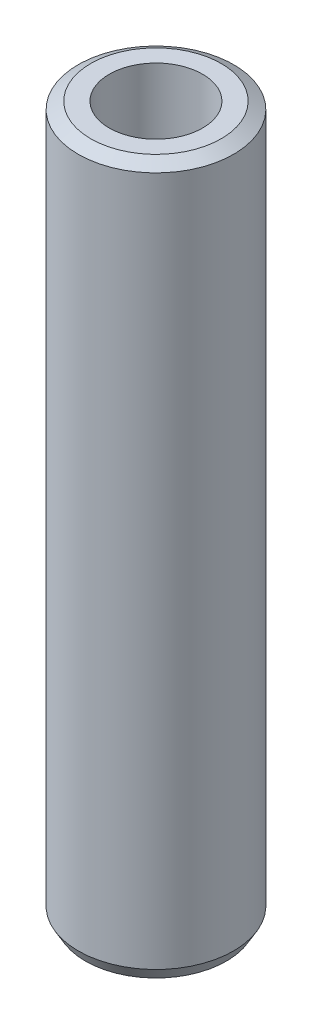
ISO-10303-21;
HEADER;
FILE_DESCRIPTION(('STEP AP214'),'2;1');
FILE_NAME('part.step','',(''),(''),'','','');
FILE_SCHEMA(('AUTOMOTIVE_DESIGN { 1 0 10303 214 1 1 1 1 }'));
ENDSEC;
DATA;
#1=APPLICATION_CONTEXT('core data for automotive mechanical design processes');
#2=APPLICATION_PROTOCOL_DEFINITION('international standard','automotive_design',2000,#1);
#3=PRODUCT_CONTEXT('',#1,'mechanical');
#4=PRODUCT('Part','Part','',(#3));
#5=PRODUCT_RELATED_PRODUCT_CATEGORY('part','',(#4));
#6=PRODUCT_DEFINITION_FORMATION('','',#4);
#7=PRODUCT_DEFINITION_CONTEXT('part definition',#1,'design');
#8=PRODUCT_DEFINITION('design','',#6,#7);
#9=PRODUCT_DEFINITION_SHAPE('','',#8);
#10=(LENGTH_UNIT() NAMED_UNIT(*) SI_UNIT(.MILLI.,.METRE.));
#11=(NAMED_UNIT(*) PLANE_ANGLE_UNIT() SI_UNIT($,.RADIAN.));
#12=(NAMED_UNIT(*) SI_UNIT($,.STERADIAN.) SOLID_ANGLE_UNIT());
#13=UNCERTAINTY_MEASURE_WITH_UNIT(LENGTH_MEASURE(1.E-05),#10,'distance_accuracy_value','');
#14=(GEOMETRIC_REPRESENTATION_CONTEXT(3) GLOBAL_UNCERTAINTY_ASSIGNED_CONTEXT((#13)) GLOBAL_UNIT_ASSIGNED_CONTEXT((#10,
#11,#12)) REPRESENTATION_CONTEXT('',''));
#15=CARTESIAN_POINT('',(0.,0.,0.));
#16=DIRECTION('',(0.,0.,1.));
#17=DIRECTION('',(1.,0.,0.));
#18=AXIS2_PLACEMENT_3D('',#15,#16,#17);
#19=CARTESIAN_POINT('',(0.,91.3014104853771,0.));
#20=DIRECTION('',(0.,-1.,0.));
#21=DIRECTION('',(0.,0.,-1.));
#22=AXIS2_PLACEMENT_3D('',#19,#20,#21);
#23=CYLINDRICAL_SURFACE('',#22,10.);
#24=CARTESIAN_POINT('',(0.,90.3734418318299,0.));
#25=DIRECTION('',(0.,1.,0.));
#26=DIRECTION('',(0.,0.,1.));
#27=AXIS2_PLACEMENT_3D('',#24,#25,#26);
#28=CIRCLE('',#27,10.);
#29=CARTESIAN_POINT('',(0.,90.3734418318299,10.));
#30=VERTEX_POINT('',#29);
#31=EDGE_CURVE('E50',#30,#30,#28,.F.);
#32=ORIENTED_EDGE('',*,*,#31,.T.);
#33=EDGE_LOOP('',(#32));
#34=FACE_BOUND('',#33,.T.);
#35=CARTESIAN_POINT('',(0.,1.607288855775,0.));
#36=DIRECTION('',(0.,1.,0.));
#37=DIRECTION('',(0.,0.,1.));
#38=AXIS2_PLACEMENT_3D('',#35,#36,#37);
#39=CIRCLE('',#38,10.);
#40=CARTESIAN_POINT('',(0.,1.607288855775,10.));
#41=VERTEX_POINT('',#40);
#42=EDGE_CURVE('E51',#41,#41,#39,.T.);
#43=ORIENTED_EDGE('',*,*,#42,.T.);
#44=EDGE_LOOP('',(#43));
#45=FACE_BOUND('',#44,.T.);
#46=ADVANCED_FACE('F39',(#34,#45),#23,.T.);
#47=CARTESIAN_POINT('',(0.,91.3014104853771,0.));
#48=DIRECTION('',(0.,1.,0.));
#49=DIRECTION('',(0.,0.,1.));
#50=AXIS2_PLACEMENT_3D('',#47,#48,#49);
#51=PLANE('',#50);
#52=CARTESIAN_POINT('',(0.,91.3014104853771,0.));
#53=DIRECTION('',(0.,1.,0.));
#54=DIRECTION('',(0.,0.,1.));
#55=AXIS2_PLACEMENT_3D('',#52,#53,#54);
#56=CIRCLE('',#55,8.39271114422505);
#57=CARTESIAN_POINT('',(0.,91.3014104853771,8.39271114422505));
#58=VERTEX_POINT('',#57);
#59=EDGE_CURVE('E54',#58,#58,#56,.T.);
#60=ORIENTED_EDGE('',*,*,#59,.T.);
#61=EDGE_LOOP('',(#60));
#62=FACE_BOUND('',#61,.T.);
#63=CARTESIAN_POINT('',(0.,91.3014104853771,0.));
#64=DIRECTION('',(0.,1.,0.));
#65=DIRECTION('',(0.,0.,1.));
#66=AXIS2_PLACEMENT_3D('',#63,#64,#65);
#67=CIRCLE('',#66,6.00686400502853);
#68=CARTESIAN_POINT('',(0.,91.3014104853771,6.00686400502853));
#69=VERTEX_POINT('',#68);
#70=EDGE_CURVE('E58',#69,#69,#67,.T.);
#71=ORIENTED_EDGE('',*,*,#70,.F.);
#72=EDGE_LOOP('',(#71));
#73=FACE_BOUND('',#72,.T.);
#74=ADVANCED_FACE('F69',(#62,#73),#51,.T.);
#75=CARTESIAN_POINT('',(0.,0.,0.));
#76=DIRECTION('',(0.,1.,0.));
#77=DIRECTION('',(0.,0.,1.));
#78=AXIS2_PLACEMENT_3D('',#75,#76,#77);
#79=PLANE('',#78);
#80=CARTESIAN_POINT('',(0.,0.,0.));
#81=DIRECTION('',(0.,1.,0.));
#82=DIRECTION('',(0.,0.,1.));
#83=AXIS2_PLACEMENT_3D('',#80,#81,#82);
#84=CIRCLE('',#83,9.07203134645281);
#85=CARTESIAN_POINT('',(0.,0.,9.07203134645281));
#86=VERTEX_POINT('',#85);
#87=EDGE_CURVE('E10',#86,#86,#84,.F.);
#88=ORIENTED_EDGE('',*,*,#87,.T.);
#89=EDGE_LOOP('',(#88));
#90=FACE_BOUND('',#89,.T.);
#91=CARTESIAN_POINT('',(0.,0.,0.));
#92=DIRECTION('',(0.,1.,0.));
#93=DIRECTION('',(0.,0.,1.));
#94=AXIS2_PLACEMENT_3D('',#91,#92,#93);
#95=CIRCLE('',#94,6.00686400502853);
#96=CARTESIAN_POINT('',(0.,0.,6.00686400502853));
#97=VERTEX_POINT('',#96);
#98=EDGE_CURVE('E63',#97,#97,#95,.T.);
#99=ORIENTED_EDGE('',*,*,#98,.T.);
#100=EDGE_LOOP('',(#99));
#101=FACE_BOUND('',#100,.T.);
#102=ADVANCED_FACE('F75',(#90,#101),#79,.F.);
#103=CARTESIAN_POINT('',(0.,91.3014104853771,0.));
#104=DIRECTION('',(0.,-1.,0.));
#105=DIRECTION('',(0.,0.,-1.));
#106=AXIS2_PLACEMENT_3D('',#103,#104,#105);
#107=CYLINDRICAL_SURFACE('',#106,6.00686400502853);
#108=ORIENTED_EDGE('',*,*,#70,.T.);
#109=EDGE_LOOP('',(#108));
#110=FACE_BOUND('',#109,.T.);
#111=ORIENTED_EDGE('',*,*,#98,.F.);
#112=EDGE_LOOP('',(#111));
#113=FACE_BOUND('',#112,.T.);
#114=ADVANCED_FACE('F70',(#110,#113),#107,.F.);
#115=CARTESIAN_POINT('',(0.,91.3014104853771,0.));
#116=DIRECTION('',(0.,-1.,0.));
#117=DIRECTION('',(0.,0.,-1.));
#118=AXIS2_PLACEMENT_3D('',#115,#116,#117);
#119=CONICAL_SURFACE('',#118,8.39271114422505,1.04719755119659);
#120=ORIENTED_EDGE('',*,*,#31,.F.);
#121=EDGE_LOOP('',(#120));
#122=FACE_BOUND('',#121,.T.);
#123=ORIENTED_EDGE('',*,*,#59,.F.);
#124=EDGE_LOOP('',(#123));
#125=FACE_BOUND('',#124,.T.);
#126=ADVANCED_FACE('F81',(#122,#125),#119,.T.);
#127=CARTESIAN_POINT('',(0.,1.607288855775,0.));
#128=DIRECTION('',(0.,1.,0.));
#129=DIRECTION('',(0.,0.,1.));
#130=AXIS2_PLACEMENT_3D('',#127,#128,#129);
#131=CONICAL_SURFACE('',#130,10.,0.523598775598301);
#132=CARTESIAN_POINT('',(0.,0.,9.07203134645281));
#133=CARTESIAN_POINT('',(0.,0.0167425922476565,9.08169768659393));
#134=CARTESIAN_POINT('',(0.,0.0334851844953127,9.09136402673504));
#135=CARTESIAN_POINT('',(0.,0.066970368990625,9.11069670701728));
#136=CARTESIAN_POINT('',(0.,0.0837129612382811,9.12036304715839));
#137=CARTESIAN_POINT('',(0.,0.117198145733594,9.13969572744063));
#138=CARTESIAN_POINT('',(0.,0.13394073798125,9.14936206758174));
#139=CARTESIAN_POINT('',(0.,0.167425922476563,9.16869474786398));
#140=CARTESIAN_POINT('',(0.,0.184168514724219,9.17836108800509));
#141=CARTESIAN_POINT('',(0.,0.217653699219532,9.19769376828733));
#142=CARTESIAN_POINT('',(0.,0.234396291467188,9.20736010842844));
#143=CARTESIAN_POINT('',(0.,0.267881475962501,9.22669278871068));
#144=CARTESIAN_POINT('',(0.,0.284624068210157,9.23635912885179));
#145=CARTESIAN_POINT('',(0.,0.318109252705469,9.25569180913403));
#146=CARTESIAN_POINT('',(0.,0.334851844953126,9.26535814927514));
#147=CARTESIAN_POINT('',(0.,0.368337029448439,9.28469082955738));
#148=CARTESIAN_POINT('',(0.,0.385079621696095,9.29435716969849));
#149=CARTESIAN_POINT('',(0.,0.418564806191407,9.31368984998073));
#150=CARTESIAN_POINT('',(0.,0.435307398439064,9.32335619012184));
#151=CARTESIAN_POINT('',(0.,0.468792582934376,9.34268887040407));
#152=CARTESIAN_POINT('',(0.,0.485535175182032,9.35235521054519));
#153=CARTESIAN_POINT('',(0.,0.519020359677345,9.37168789082743));
#154=CARTESIAN_POINT('',(0.,0.535762951925001,9.38135423096854));
#155=CARTESIAN_POINT('',(0.,0.569248136420314,9.40068691125077));
#156=CARTESIAN_POINT('',(0.,0.58599072866797,9.41035325139189));
#157=CARTESIAN_POINT('',(0.,0.619475913163283,9.42968593167413));
#158=CARTESIAN_POINT('',(0.,0.636218505410939,9.43935227181524));
#159=CARTESIAN_POINT('',(0.,0.669703689906252,9.45868495209747));
#160=CARTESIAN_POINT('',(0.,0.686446282153908,9.46835129223859));
#161=CARTESIAN_POINT('',(0.,0.719931466649221,9.48768397252082));
#162=CARTESIAN_POINT('',(0.,0.736674058896877,9.49735031266194));
#163=CARTESIAN_POINT('',(0.,0.77015924339219,9.51668299294417));
#164=CARTESIAN_POINT('',(0.,0.786901835639846,9.52634933308529));
#165=CARTESIAN_POINT('',(0.,0.820387020135159,9.54568201336752));
#166=CARTESIAN_POINT('',(0.,0.837129612382815,9.55534835350864));
#167=CARTESIAN_POINT('',(0.,0.870614796878127,9.57468103379087));
#168=CARTESIAN_POINT('',(0.,0.887357389125784,9.58434737393199));
#169=CARTESIAN_POINT('',(0.,0.920842573621096,9.60368005421422));
#170=CARTESIAN_POINT('',(0.,0.937585165868752,9.61334639435534));
#171=CARTESIAN_POINT('',(0.,0.971070350364065,9.63267907463757));
#172=CARTESIAN_POINT('',(0.,0.987812942611722,9.64234541477869));
#173=CARTESIAN_POINT('',(0.,1.02129812710703,9.66167809506092));
#174=CARTESIAN_POINT('',(0.,1.03804071935469,9.67134443520204));
#175=CARTESIAN_POINT('',(0.,1.07152590385,9.69067711548427));
#176=CARTESIAN_POINT('',(0.,1.08826849609766,9.70034345562539));
#177=CARTESIAN_POINT('',(0.,1.12175368059297,9.71967613590762));
#178=CARTESIAN_POINT('',(0.,1.13849627284063,9.72934247604874));
#179=CARTESIAN_POINT('',(0.,1.17198145733594,9.74867515633097));
#180=CARTESIAN_POINT('',(0.,1.1887240495836,9.75834149647209));
#181=CARTESIAN_POINT('',(0.,1.22220923407891,9.77767417675432));
#182=CARTESIAN_POINT('',(0.,1.23895182632657,9.78734051689544));
#183=CARTESIAN_POINT('',(0.,1.27243701082188,9.80667319717767));
#184=CARTESIAN_POINT('',(0.,1.28917960306954,9.81633953731879));
#185=CARTESIAN_POINT('',(0.,1.32266478756485,9.83567221760102));
#186=CARTESIAN_POINT('',(0.,1.3394073798125,9.84533855774214));
#187=CARTESIAN_POINT('',(0.,1.37289256430782,9.86467123802437));
#188=CARTESIAN_POINT('',(0.,1.38963515655547,9.87433757816548));
#189=CARTESIAN_POINT('',(0.,1.42312034105079,9.89367025844772));
#190=CARTESIAN_POINT('',(0.,1.43986293329844,9.90333659858883));
#191=CARTESIAN_POINT('',(0.,1.47334811779375,9.92266927887107));
#192=CARTESIAN_POINT('',(0.,1.49009071004141,9.93233561901218));
#193=CARTESIAN_POINT('',(0.,1.52357589453672,9.95166829929442));
#194=CARTESIAN_POINT('',(0.,1.54031848678438,9.96133463943553));
#195=CARTESIAN_POINT('',(0.,1.57380367127969,9.98066731971777));
#196=CARTESIAN_POINT('',(0.,1.59054626352735,9.99033365985888));
#197=CARTESIAN_POINT('',(0.,1.607288855775,10.));
#198=B_SPLINE_CURVE_WITH_KNOTS('',3,(#132,#133,#134,#135,#136,#137,#138,#139,#140,#141,#142,
#143,#144,#145,#146,#147,#148,#149,#150,#151,#152,#153,#154,#155,#156,#157,#158,#159,#160,#161,
#162,#163,#164,#165,#166,#167,#168,#169,#170,#171,#172,#173,#174,#175,#176,#177,#178,#179,#180,
#181,#182,#183,#184,#185,#186,#187,#188,#189,#190,#191,#192,#193,#194,#195,#196,#197),
.UNSPECIFIED.,.F.,.F.,(4,2,2,2,2,2,2,2,2,2,2,2,2,2,2,2,2,2,2,2,2,2,2,2,2,2,2,2,2,2,2,2,4),(0.,
0.0579980408466987,0.115996081693398,0.173994122540097,0.231992163386796,0.289990204233495,
0.347988245080195,0.405986285926894,0.463984326773593,0.521982367620292,0.579980408466991,
0.63797844931369,0.69597649016039,0.753974531007088,0.811972571853787,0.869970612700487,
0.927968653547185,0.985966694393885,1.04396473524058,1.10196277608728,1.15996081693398,
1.21795885778068,1.27595689862738,1.33395493947408,1.39195298032078,1.44995102116748,
1.50794906201418,1.56594710286088,1.62394514370758,1.68194318455427,1.73994122540097,
1.79793926624767,1.85593730709437),.UNSPECIFIED.);
#199=EDGE_CURVE('BSEAM45',#86,#41,#198,.T.);
#200=ORIENTED_EDGE('',*,*,#87,.F.);
#201=ORIENTED_EDGE('',*,*,#42,.F.);
#202=ORIENTED_EDGE('',*,*,#199,.T.);
#203=ORIENTED_EDGE('',*,*,#199,.F.);
#204=EDGE_LOOP('',(#200,#202,#201,#203));
#205=FACE_BOUND('',#204,.T.);
#206=ADVANCED_FACE('F45',(#205),#131,.T.);
#207=CLOSED_SHELL('',(#46,#74,#102,#114,#126,#206));
#208=MANIFOLD_SOLID_BREP('B2',#207);
#209=ADVANCED_BREP_SHAPE_REPRESENTATION('',(#18,#208),#14);
#210=SHAPE_DEFINITION_REPRESENTATION(#9,#209);
ENDSEC;
END-ISO-10303-21;
